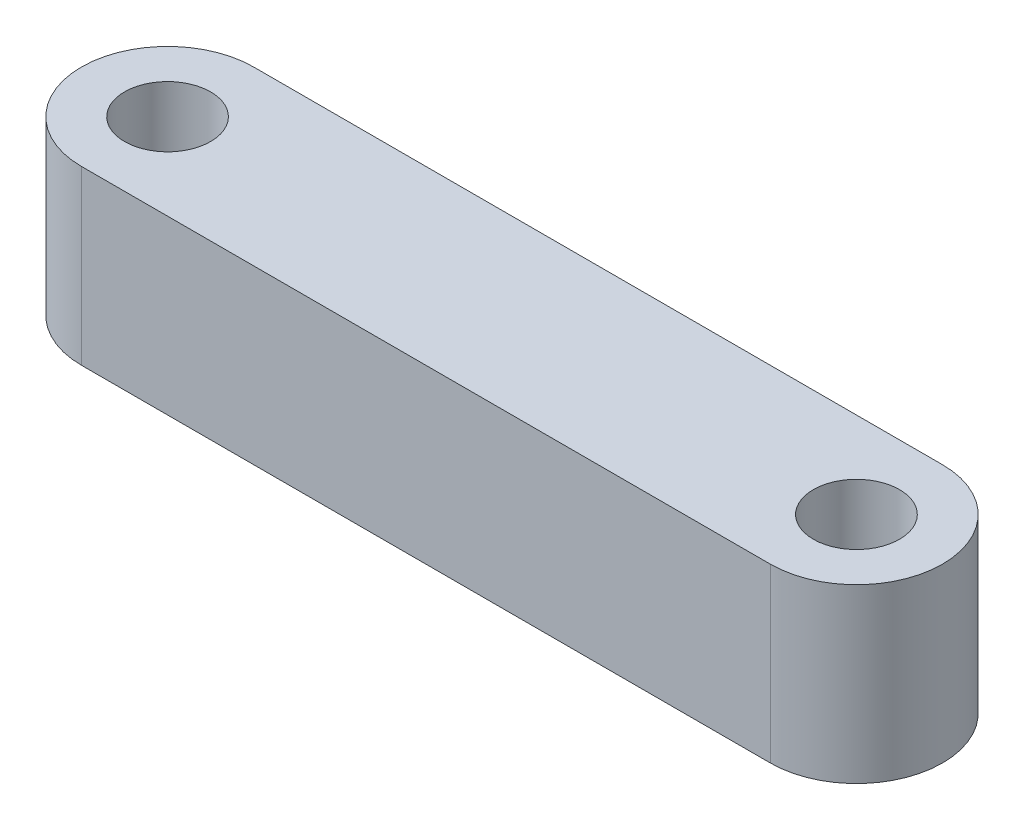
ISO-10303-21;
HEADER;
FILE_DESCRIPTION(('STEP AP214'),'2;1');
FILE_NAME('part.step','',(''),(''),'','','');
FILE_SCHEMA(('AUTOMOTIVE_DESIGN { 1 0 10303 214 1 1 1 1 }'));
ENDSEC;
DATA;
#1=APPLICATION_CONTEXT('core data for automotive mechanical design processes');
#2=APPLICATION_PROTOCOL_DEFINITION('international standard','automotive_design',2000,#1);
#3=PRODUCT_CONTEXT('',#1,'mechanical');
#4=PRODUCT('Part','Part','',(#3));
#5=PRODUCT_RELATED_PRODUCT_CATEGORY('part','',(#4));
#6=PRODUCT_DEFINITION_FORMATION('','',#4);
#7=PRODUCT_DEFINITION_CONTEXT('part definition',#1,'design');
#8=PRODUCT_DEFINITION('design','',#6,#7);
#9=PRODUCT_DEFINITION_SHAPE('','',#8);
#10=(LENGTH_UNIT() NAMED_UNIT(*) SI_UNIT(.MILLI.,.METRE.));
#11=(NAMED_UNIT(*) PLANE_ANGLE_UNIT() SI_UNIT($,.RADIAN.));
#12=(NAMED_UNIT(*) SI_UNIT($,.STERADIAN.) SOLID_ANGLE_UNIT());
#13=UNCERTAINTY_MEASURE_WITH_UNIT(LENGTH_MEASURE(1.E-05),#10,'distance_accuracy_value','');
#14=(GEOMETRIC_REPRESENTATION_CONTEXT(3) GLOBAL_UNCERTAINTY_ASSIGNED_CONTEXT((#13)) GLOBAL_UNIT_ASSIGNED_CONTEXT((#10,
#11,#12)) REPRESENTATION_CONTEXT('',''));
#15=CARTESIAN_POINT('',(0.,0.,0.));
#16=DIRECTION('',(0.,0.,1.));
#17=DIRECTION('',(1.,0.,0.));
#18=AXIS2_PLACEMENT_3D('',#15,#16,#17);
#19=CARTESIAN_POINT('',(120.,30.,0.));
#20=DIRECTION('',(0.,-1.,0.));
#21=DIRECTION('',(0.,0.,-1.));
#22=AXIS2_PLACEMENT_3D('',#19,#20,#21);
#23=CYLINDRICAL_SURFACE('',#22,15.);
#24=CARTESIAN_POINT('',(120.,0.,0.));
#25=DIRECTION('',(0.,1.,0.));
#26=DIRECTION('',(0.,0.,1.));
#27=AXIS2_PLACEMENT_3D('',#24,#25,#26);
#28=CIRCLE('',#27,15.);
#29=CARTESIAN_POINT('',(120.,0.,-15.));
#30=VERTEX_POINT('',#29);
#31=CARTESIAN_POINT('',(120.,0.,15.));
#32=VERTEX_POINT('',#31);
#33=EDGE_CURVE('E117',#30,#32,#28,.F.);
#34=ORIENTED_EDGE('',*,*,#33,.F.);
#35=DIRECTION('',(0.,-1.,0.));
#36=VECTOR('',#35,1.);
#37=CARTESIAN_POINT('',(120.,30.,-15.));
#38=LINE('',#37,#36);
#39=CARTESIAN_POINT('',(120.,30.,-15.));
#40=VERTEX_POINT('',#39);
#41=EDGE_CURVE('E11',#40,#30,#38,.T.);
#42=ORIENTED_EDGE('',*,*,#41,.F.);
#43=CARTESIAN_POINT('',(120.,30.,0.));
#44=DIRECTION('',(0.,1.,0.));
#45=DIRECTION('',(0.,0.,1.));
#46=AXIS2_PLACEMENT_3D('',#43,#44,#45);
#47=CIRCLE('',#46,15.);
#48=CARTESIAN_POINT('',(120.,30.,15.));
#49=VERTEX_POINT('',#48);
#50=EDGE_CURVE('E100',#40,#49,#47,.F.);
#51=ORIENTED_EDGE('',*,*,#50,.T.);
#52=DIRECTION('',(0.,-1.,0.));
#53=VECTOR('',#52,1.);
#54=CARTESIAN_POINT('',(120.,30.,15.));
#55=LINE('',#54,#53);
#56=EDGE_CURVE('E78',#49,#32,#55,.T.);
#57=ORIENTED_EDGE('',*,*,#56,.T.);
#58=EDGE_LOOP('',(#34,#42,#51,#57));
#59=FACE_BOUND('',#58,.T.);
#60=ADVANCED_FACE('F39',(#59),#23,.T.);
#61=CARTESIAN_POINT('',(0.,30.,-15.));
#62=DIRECTION('',(0.,0.,-1.));
#63=DIRECTION('',(-1.,0.,0.));
#64=AXIS2_PLACEMENT_3D('',#61,#62,#63);
#65=PLANE('',#64);
#66=DIRECTION('',(1.,0.,0.));
#67=VECTOR('',#66,1.);
#68=CARTESIAN_POINT('',(0.,0.,-15.));
#69=LINE('',#68,#67);
#70=CARTESIAN_POINT('',(0.,0.,-15.));
#71=VERTEX_POINT('',#70);
#72=EDGE_CURVE('E91',#71,#30,#69,.T.);
#73=ORIENTED_EDGE('',*,*,#72,.F.);
#74=DIRECTION('',(0.,-1.,0.));
#75=VECTOR('',#74,1.);
#76=CARTESIAN_POINT('',(0.,30.,-15.));
#77=LINE('',#76,#75);
#78=CARTESIAN_POINT('',(0.,30.,-15.));
#79=VERTEX_POINT('',#78);
#80=EDGE_CURVE('E48',#79,#71,#77,.T.);
#81=ORIENTED_EDGE('',*,*,#80,.F.);
#82=DIRECTION('',(1.,0.,0.));
#83=VECTOR('',#82,1.);
#84=CARTESIAN_POINT('',(0.,30.,-15.));
#85=LINE('',#84,#83);
#86=EDGE_CURVE('E89',#79,#40,#85,.T.);
#87=ORIENTED_EDGE('',*,*,#86,.T.);
#88=ORIENTED_EDGE('',*,*,#41,.T.);
#89=EDGE_LOOP('',(#73,#81,#87,#88));
#90=FACE_BOUND('',#89,.T.);
#91=ADVANCED_FACE('F87',(#90),#65,.T.);
#92=CARTESIAN_POINT('',(0.,30.,0.));
#93=DIRECTION('',(0.,-1.,0.));
#94=DIRECTION('',(0.,0.,-1.));
#95=AXIS2_PLACEMENT_3D('',#92,#93,#94);
#96=CYLINDRICAL_SURFACE('',#95,15.);
#97=CARTESIAN_POINT('',(0.,0.,0.));
#98=DIRECTION('',(0.,1.,0.));
#99=DIRECTION('',(0.,0.,1.));
#100=AXIS2_PLACEMENT_3D('',#97,#98,#99);
#101=CIRCLE('',#100,15.);
#102=CARTESIAN_POINT('',(0.,0.,15.));
#103=VERTEX_POINT('',#102);
#104=EDGE_CURVE('E71',#71,#103,#101,.T.);
#105=ORIENTED_EDGE('',*,*,#104,.T.);
#106=DIRECTION('',(0.,-1.,0.));
#107=VECTOR('',#106,1.);
#108=CARTESIAN_POINT('',(0.,30.,15.));
#109=LINE('',#108,#107);
#110=CARTESIAN_POINT('',(0.,30.,15.));
#111=VERTEX_POINT('',#110);
#112=EDGE_CURVE('E93',#111,#103,#109,.T.);
#113=ORIENTED_EDGE('',*,*,#112,.F.);
#114=CARTESIAN_POINT('',(0.,30.,0.));
#115=DIRECTION('',(0.,1.,0.));
#116=DIRECTION('',(0.,0.,1.));
#117=AXIS2_PLACEMENT_3D('',#114,#115,#116);
#118=CIRCLE('',#117,15.);
#119=EDGE_CURVE('E94',#79,#111,#118,.T.);
#120=ORIENTED_EDGE('',*,*,#119,.F.);
#121=ORIENTED_EDGE('',*,*,#80,.T.);
#122=EDGE_LOOP('',(#105,#113,#120,#121));
#123=FACE_BOUND('',#122,.T.);
#124=ADVANCED_FACE('F95',(#123),#96,.T.);
#125=CARTESIAN_POINT('',(0.,30.,0.));
#126=DIRECTION('',(0.,-1.,0.));
#127=DIRECTION('',(0.,0.,-1.));
#128=AXIS2_PLACEMENT_3D('',#125,#126,#127);
#129=CYLINDRICAL_SURFACE('',#128,7.5);
#130=CARTESIAN_POINT('',(0.,30.,0.));
#131=DIRECTION('',(0.,1.,0.));
#132=DIRECTION('',(0.,0.,1.));
#133=AXIS2_PLACEMENT_3D('',#130,#131,#132);
#134=CIRCLE('',#133,7.5);
#135=CARTESIAN_POINT('',(0.,30.,7.5));
#136=VERTEX_POINT('',#135);
#137=EDGE_CURVE('E109',#136,#136,#134,.T.);
#138=ORIENTED_EDGE('',*,*,#137,.T.);
#139=EDGE_LOOP('',(#138));
#140=FACE_BOUND('',#139,.T.);
#141=CARTESIAN_POINT('',(0.,0.,0.));
#142=DIRECTION('',(0.,1.,0.));
#143=DIRECTION('',(0.,0.,1.));
#144=AXIS2_PLACEMENT_3D('',#141,#142,#143);
#145=CIRCLE('',#144,7.5);
#146=CARTESIAN_POINT('',(0.,0.,7.5));
#147=VERTEX_POINT('',#146);
#148=EDGE_CURVE('E128',#147,#147,#145,.T.);
#149=ORIENTED_EDGE('',*,*,#148,.F.);
#150=EDGE_LOOP('',(#149));
#151=FACE_BOUND('',#150,.T.);
#152=ADVANCED_FACE('F151',(#140,#151),#129,.F.);
#153=CARTESIAN_POINT('',(0.,30.,15.));
#154=DIRECTION('',(0.,0.,-1.));
#155=DIRECTION('',(-1.,0.,0.));
#156=AXIS2_PLACEMENT_3D('',#153,#154,#155);
#157=PLANE('',#156);
#158=DIRECTION('',(1.,0.,0.));
#159=VECTOR('',#158,1.);
#160=CARTESIAN_POINT('',(0.,0.,15.));
#161=LINE('',#160,#159);
#162=EDGE_CURVE('E125',#103,#32,#161,.T.);
#163=ORIENTED_EDGE('',*,*,#162,.T.);
#164=ORIENTED_EDGE('',*,*,#56,.F.);
#165=DIRECTION('',(1.,0.,0.));
#166=VECTOR('',#165,1.);
#167=CARTESIAN_POINT('',(0.,30.,15.));
#168=LINE('',#167,#166);
#169=EDGE_CURVE('E56',#111,#49,#168,.T.);
#170=ORIENTED_EDGE('',*,*,#169,.F.);
#171=ORIENTED_EDGE('',*,*,#112,.T.);
#172=EDGE_LOOP('',(#163,#164,#170,#171));
#173=FACE_BOUND('',#172,.T.);
#174=ADVANCED_FACE('F140',(#173),#157,.F.);
#175=CARTESIAN_POINT('',(120.,30.,0.));
#176=DIRECTION('',(0.,-1.,0.));
#177=DIRECTION('',(0.,0.,-1.));
#178=AXIS2_PLACEMENT_3D('',#175,#176,#177);
#179=CYLINDRICAL_SURFACE('',#178,7.5);
#180=CARTESIAN_POINT('',(120.,30.,0.));
#181=DIRECTION('',(0.,1.,0.));
#182=DIRECTION('',(0.,0.,1.));
#183=AXIS2_PLACEMENT_3D('',#180,#181,#182);
#184=CIRCLE('',#183,7.5);
#185=CARTESIAN_POINT('',(120.,30.,7.5));
#186=VERTEX_POINT('',#185);
#187=EDGE_CURVE('E113',#186,#186,#184,.F.);
#188=ORIENTED_EDGE('',*,*,#187,.F.);
#189=EDGE_LOOP('',(#188));
#190=FACE_BOUND('',#189,.T.);
#191=CARTESIAN_POINT('',(120.,0.,0.));
#192=DIRECTION('',(0.,1.,0.));
#193=DIRECTION('',(0.,0.,1.));
#194=AXIS2_PLACEMENT_3D('',#191,#192,#193);
#195=CIRCLE('',#194,7.5);
#196=CARTESIAN_POINT('',(120.,0.,7.5));
#197=VERTEX_POINT('',#196);
#198=EDGE_CURVE('E104',#197,#197,#195,.F.);
#199=ORIENTED_EDGE('',*,*,#198,.T.);
#200=EDGE_LOOP('',(#199));
#201=FACE_BOUND('',#200,.T.);
#202=ADVANCED_FACE('F156',(#190,#201),#179,.F.);
#203=CARTESIAN_POINT('',(0.,30.,0.));
#204=DIRECTION('',(0.,1.,0.));
#205=DIRECTION('',(0.,0.,1.));
#206=AXIS2_PLACEMENT_3D('',#203,#204,#205);
#207=PLANE('',#206);
#208=ORIENTED_EDGE('',*,*,#50,.F.);
#209=ORIENTED_EDGE('',*,*,#86,.F.);
#210=ORIENTED_EDGE('',*,*,#119,.T.);
#211=ORIENTED_EDGE('',*,*,#169,.T.);
#212=EDGE_LOOP('',(#208,#209,#210,#211));
#213=FACE_BOUND('',#212,.T.);
#214=ORIENTED_EDGE('',*,*,#137,.F.);
#215=EDGE_LOOP('',(#214));
#216=FACE_BOUND('',#215,.T.);
#217=ORIENTED_EDGE('',*,*,#187,.T.);
#218=EDGE_LOOP('',(#217));
#219=FACE_BOUND('',#218,.T.);
#220=ADVANCED_FACE('F98',(#213,#216,#219),#207,.T.);
#221=CARTESIAN_POINT('',(0.,0.,0.));
#222=DIRECTION('',(0.,1.,0.));
#223=DIRECTION('',(0.,0.,1.));
#224=AXIS2_PLACEMENT_3D('',#221,#222,#223);
#225=PLANE('',#224);
#226=ORIENTED_EDGE('',*,*,#33,.T.);
#227=ORIENTED_EDGE('',*,*,#162,.F.);
#228=ORIENTED_EDGE('',*,*,#104,.F.);
#229=ORIENTED_EDGE('',*,*,#72,.T.);
#230=EDGE_LOOP('',(#226,#227,#228,#229));
#231=FACE_BOUND('',#230,.T.);
#232=ORIENTED_EDGE('',*,*,#148,.T.);
#233=EDGE_LOOP('',(#232));
#234=FACE_BOUND('',#233,.T.);
#235=ORIENTED_EDGE('',*,*,#198,.F.);
#236=EDGE_LOOP('',(#235));
#237=FACE_BOUND('',#236,.T.);
#238=ADVANCED_FACE('F142',(#231,#234,#237),#225,.F.);
#239=CLOSED_SHELL('',(#60,#91,#124,#152,#174,#202,#220,#238));
#240=MANIFOLD_SOLID_BREP('B2',#239);
#241=ADVANCED_BREP_SHAPE_REPRESENTATION('',(#18,#240),#14);
#242=SHAPE_DEFINITION_REPRESENTATION(#9,#241);
ENDSEC;
END-ISO-10303-21;
